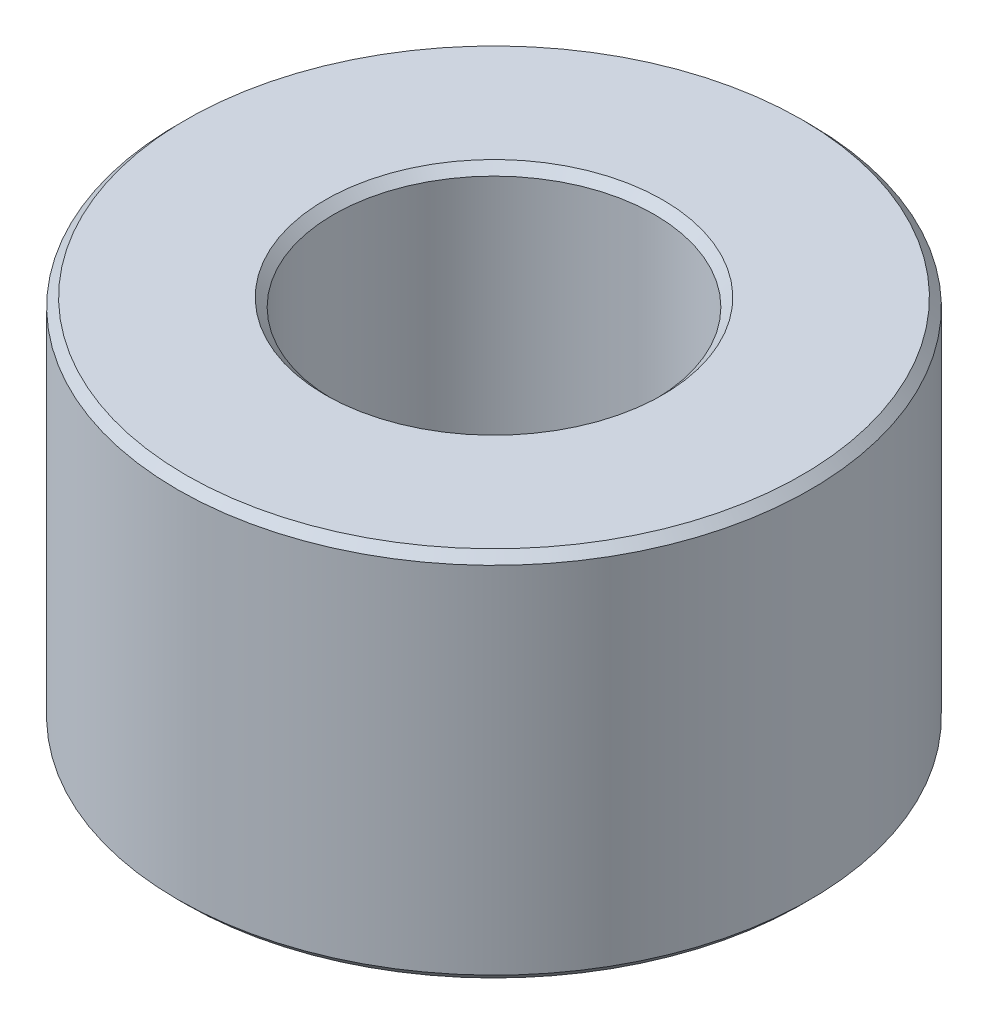
ISO-10303-21;
HEADER;
FILE_DESCRIPTION(('STEP AP214'),'2;1');
FILE_NAME('part.step','',(''),(''),'','','');
FILE_SCHEMA(('AUTOMOTIVE_DESIGN { 1 0 10303 214 1 1 1 1 }'));
ENDSEC;
DATA;
#1=APPLICATION_CONTEXT('core data for automotive mechanical design processes');
#2=APPLICATION_PROTOCOL_DEFINITION('international standard','automotive_design',2000,#1);
#3=PRODUCT_CONTEXT('',#1,'mechanical');
#4=PRODUCT('Part','Part','',(#3));
#5=PRODUCT_RELATED_PRODUCT_CATEGORY('part','',(#4));
#6=PRODUCT_DEFINITION_FORMATION('','',#4);
#7=PRODUCT_DEFINITION_CONTEXT('part definition',#1,'design');
#8=PRODUCT_DEFINITION('design','',#6,#7);
#9=PRODUCT_DEFINITION_SHAPE('','',#8);
#10=(LENGTH_UNIT() NAMED_UNIT(*) SI_UNIT(.MILLI.,.METRE.));
#11=(NAMED_UNIT(*) PLANE_ANGLE_UNIT() SI_UNIT($,.RADIAN.));
#12=(NAMED_UNIT(*) SI_UNIT($,.STERADIAN.) SOLID_ANGLE_UNIT());
#13=UNCERTAINTY_MEASURE_WITH_UNIT(LENGTH_MEASURE(1.E-05),#10,'distance_accuracy_value','');
#14=(GEOMETRIC_REPRESENTATION_CONTEXT(3) GLOBAL_UNCERTAINTY_ASSIGNED_CONTEXT((#13)) GLOBAL_UNIT_ASSIGNED_CONTEXT((#10,
#11,#12)) REPRESENTATION_CONTEXT('',''));
#15=CARTESIAN_POINT('',(0.,0.,0.));
#16=DIRECTION('',(0.,0.,1.));
#17=DIRECTION('',(1.,0.,0.));
#18=AXIS2_PLACEMENT_3D('',#15,#16,#17);
#19=CARTESIAN_POINT('',(0.,38.1927468293201,0.));
#20=DIRECTION('',(0.,-1.,0.));
#21=DIRECTION('',(0.,0.,-1.));
#22=AXIS2_PLACEMENT_3D('',#19,#20,#21);
#23=CYLINDRICAL_SURFACE('',#22,32.5);
#24=CARTESIAN_POINT('',(0.,0.865475347554302,0.));
#25=DIRECTION('',(0.,1.,0.));
#26=DIRECTION('',(0.,0.,1.));
#27=AXIS2_PLACEMENT_3D('',#24,#25,#26);
#28=CIRCLE('',#27,32.5);
#29=CARTESIAN_POINT('',(0.,0.865475347554302,-32.5));
#30=VERTEX_POINT('',#29);
#31=EDGE_CURVE('E10',#30,#30,#28,.T.);
#32=CARTESIAN_POINT('',(0.,37.3272714817659,0.));
#33=DIRECTION('',(0.,1.,0.));
#34=DIRECTION('',(0.,0.,1.));
#35=AXIS2_PLACEMENT_3D('',#32,#33,#34);
#36=CIRCLE('',#35,32.5);
#37=CARTESIAN_POINT('',(0.,37.3272714817658,-32.5));
#38=VERTEX_POINT('',#37);
#39=EDGE_CURVE('E50',#38,#38,#36,.F.);
#40=CARTESIAN_POINT('',(0.,0.865475347554302,-32.5));
#41=CARTESIAN_POINT('',(0.,1.24528572395234,-32.5));
#42=CARTESIAN_POINT('',(0.,1.62509610035038,-32.5));
#43=CARTESIAN_POINT('',(0.,2.38471685314645,-32.5));
#44=CARTESIAN_POINT('',(0.,2.76452722954449,-32.5));
#45=CARTESIAN_POINT('',(0.,3.52414798234056,-32.5));
#46=CARTESIAN_POINT('',(0.,3.9039583587386,-32.5));
#47=CARTESIAN_POINT('',(0.,4.66357911153467,-32.5));
#48=CARTESIAN_POINT('',(0.,5.04338948793271,-32.5));
#49=CARTESIAN_POINT('',(0.,5.80301024072879,-32.5));
#50=CARTESIAN_POINT('',(0.,6.18282061712682,-32.5));
#51=CARTESIAN_POINT('',(0.,6.94244136992289,-32.5));
#52=CARTESIAN_POINT('',(0.,7.32225174632093,-32.5));
#53=CARTESIAN_POINT('',(0.,8.081872499117,-32.5));
#54=CARTESIAN_POINT('',(0.,8.46168287551504,-32.5));
#55=CARTESIAN_POINT('',(0.,9.22130362831111,-32.5));
#56=CARTESIAN_POINT('',(0.,9.60111400470915,-32.5));
#57=CARTESIAN_POINT('',(0.,10.3607347575052,-32.5));
#58=CARTESIAN_POINT('',(0.,10.7405451339033,-32.5));
#59=CARTESIAN_POINT('',(0.,11.5001658866993,-32.5));
#60=CARTESIAN_POINT('',(0.,11.8799762630974,-32.5));
#61=CARTESIAN_POINT('',(0.,12.6395970158934,-32.5));
#62=CARTESIAN_POINT('',(0.,13.0194073922915,-32.5));
#63=CARTESIAN_POINT('',(0.,13.7790281450876,-32.5));
#64=CARTESIAN_POINT('',(0.,14.1588385214856,-32.5));
#65=CARTESIAN_POINT('',(0.,14.9184592742817,-32.5));
#66=CARTESIAN_POINT('',(0.,15.2982696506797,-32.5));
#67=CARTESIAN_POINT('',(0.,16.0578904034758,-32.5));
#68=CARTESIAN_POINT('',(0.,16.4377007798738,-32.5));
#69=CARTESIAN_POINT('',(0.,17.1973215326699,-32.5));
#70=CARTESIAN_POINT('',(0.,17.5771319090679,-32.5));
#71=CARTESIAN_POINT('',(0.,18.336752661864,-32.5));
#72=CARTESIAN_POINT('',(0.,18.716563038262,-32.5));
#73=CARTESIAN_POINT('',(0.,19.4761837910581,-32.5));
#74=CARTESIAN_POINT('',(0.,19.8559941674562,-32.5));
#75=CARTESIAN_POINT('',(0.,20.6156149202522,-32.5));
#76=CARTESIAN_POINT('',(0.,20.9954252966503,-32.5));
#77=CARTESIAN_POINT('',(0.,21.7550460494463,-32.5));
#78=CARTESIAN_POINT('',(0.,22.1348564258444,-32.5));
#79=CARTESIAN_POINT('',(0.,22.8944771786404,-32.5));
#80=CARTESIAN_POINT('',(0.,23.2742875550385,-32.5));
#81=CARTESIAN_POINT('',(0.,24.0339083078346,-32.5));
#82=CARTESIAN_POINT('',(0.,24.4137186842326,-32.5));
#83=CARTESIAN_POINT('',(0.,25.1733394370287,-32.5));
#84=CARTESIAN_POINT('',(0.,25.5531498134267,-32.5));
#85=CARTESIAN_POINT('',(0.,26.3127705662228,-32.5));
#86=CARTESIAN_POINT('',(0.,26.6925809426208,-32.5));
#87=CARTESIAN_POINT('',(0.,27.4522016954169,-32.5));
#88=CARTESIAN_POINT('',(0.,27.8320120718149,-32.5));
#89=CARTESIAN_POINT('',(0.,28.591632824611,-32.5));
#90=CARTESIAN_POINT('',(0.,28.971443201009,-32.5));
#91=CARTESIAN_POINT('',(0.,29.7310639538051,-32.5));
#92=CARTESIAN_POINT('',(0.,30.1108743302031,-32.5));
#93=CARTESIAN_POINT('',(0.,30.8704950829992,-32.5));
#94=CARTESIAN_POINT('',(0.,31.2503054593973,-32.5));
#95=CARTESIAN_POINT('',(0.,32.0099262121933,-32.5));
#96=CARTESIAN_POINT('',(0.,32.3897365885914,-32.5));
#97=CARTESIAN_POINT('',(0.,33.1493573413874,-32.5));
#98=CARTESIAN_POINT('',(0.,33.5291677177855,-32.5));
#99=CARTESIAN_POINT('',(0.,34.2887884705816,-32.5));
#100=CARTESIAN_POINT('',(0.,34.6685988469796,-32.5));
#101=CARTESIAN_POINT('',(0.,35.4282195997757,-32.5));
#102=CARTESIAN_POINT('',(0.,35.8080299761737,-32.5));
#103=CARTESIAN_POINT('',(0.,36.5676507289698,-32.5));
#104=CARTESIAN_POINT('',(0.,36.9474611053678,-32.5));
#105=CARTESIAN_POINT('',(0.,37.3272714817658,-32.5));
#106=B_SPLINE_CURVE_WITH_KNOTS('',3,(#40,#41,#42,#43,#44,#45,#46,#47,#48,#49,#50,#51,#52,#53,
#54,#55,#56,#57,#58,#59,#60,#61,#62,#63,#64,#65,#66,#67,#68,#69,#70,#71,#72,#73,#74,#75,#76,#77,
#78,#79,#80,#81,#82,#83,#84,#85,#86,#87,#88,#89,#90,#91,#92,#93,#94,#95,#96,#97,#98,#99,#100,
#101,#102,#103,#104,#105),.UNSPECIFIED.,.F.,.F.,(4,2,2,2,2,2,2,2,2,2,2,2,2,2,2,2,2,2,2,2,2,2,2,
2,2,2,2,2,2,2,2,2,4),(0.,1.13943112919411,2.27886225838822,3.41829338758233,4.55772451677645,
5.69715564597056,6.83658677516466,7.97601790435877,9.11544903355288,10.254880162747,
11.3943112919411,12.5337424211352,13.6731735503293,14.8126046795234,15.9520358087176,
17.0914669379117,18.2308980671058,19.3703291962999,20.509760325494,21.6491914546881,
22.7886225838822,23.9280537130763,25.0674848422704,26.2069159714646,27.3463471006587,
28.4857782298528,29.6252093590469,30.764640488241,31.9040716174351,33.0435027466292,
34.1829338758233,35.3223650050174,36.4617961342115),.UNSPECIFIED.);
#107=EDGE_CURVE('BSEAM39',#30,#38,#106,.T.);
#108=ORIENTED_EDGE('',*,*,#31,.T.);
#109=ORIENTED_EDGE('',*,*,#39,.T.);
#110=ORIENTED_EDGE('',*,*,#107,.T.);
#111=ORIENTED_EDGE('',*,*,#107,.F.);
#112=EDGE_LOOP('',(#108,#110,#109,#111));
#113=FACE_BOUND('',#112,.T.);
#114=ADVANCED_FACE('F39',(#113),#23,.T.);
#115=CARTESIAN_POINT('',(0.,38.1927468293201,0.));
#116=DIRECTION('',(0.,1.,0.));
#117=DIRECTION('',(0.,0.,1.));
#118=AXIS2_PLACEMENT_3D('',#115,#116,#117);
#119=PLANE('',#118);
#120=CARTESIAN_POINT('',(0.,38.1927468293201,0.));
#121=DIRECTION('',(0.,1.,0.));
#122=DIRECTION('',(0.,0.,1.));
#123=AXIS2_PLACEMENT_3D('',#120,#121,#122);
#124=CIRCLE('',#123,17.3490386487337);
#125=CARTESIAN_POINT('',(0.,38.1927468293201,17.3490386487337));
#126=VERTEX_POINT('',#125);
#127=EDGE_CURVE('E58',#126,#126,#124,.F.);
#128=ORIENTED_EDGE('',*,*,#127,.T.);
#129=EDGE_LOOP('',(#128));
#130=FACE_BOUND('',#129,.T.);
#131=CARTESIAN_POINT('',(0.,38.1927468293201,0.));
#132=DIRECTION('',(0.,1.,0.));
#133=DIRECTION('',(0.,0.,1.));
#134=AXIS2_PLACEMENT_3D('',#131,#132,#133);
#135=CIRCLE('',#134,31.6345246524458);
#136=CARTESIAN_POINT('',(0.,38.1927468293201,31.6345246524458));
#137=VERTEX_POINT('',#136);
#138=EDGE_CURVE('E61',#137,#137,#135,.T.);
#139=ORIENTED_EDGE('',*,*,#138,.T.);
#140=EDGE_LOOP('',(#139));
#141=FACE_BOUND('',#140,.T.);
#142=ADVANCED_FACE('F88',(#130,#141),#119,.T.);
#143=CARTESIAN_POINT('',(0.,0.,0.));
#144=DIRECTION('',(0.,1.,0.));
#145=DIRECTION('',(0.,0.,1.));
#146=AXIS2_PLACEMENT_3D('',#143,#144,#145);
#147=PLANE('',#146);
#148=CARTESIAN_POINT('',(0.,0.,0.));
#149=DIRECTION('',(0.,1.,0.));
#150=DIRECTION('',(0.,0.,1.));
#151=AXIS2_PLACEMENT_3D('',#148,#149,#150);
#152=CIRCLE('',#151,17.3490386487337);
#153=CARTESIAN_POINT('',(0.,0.,-17.3490386487337));
#154=VERTEX_POINT('',#153);
#155=EDGE_CURVE('E51',#154,#154,#152,.T.);
#156=ORIENTED_EDGE('',*,*,#155,.T.);
#157=EDGE_LOOP('',(#156));
#158=FACE_BOUND('',#157,.T.);
#159=CARTESIAN_POINT('',(0.,0.,0.));
#160=DIRECTION('',(0.,1.,0.));
#161=DIRECTION('',(0.,0.,1.));
#162=AXIS2_PLACEMENT_3D('',#159,#160,#161);
#163=CIRCLE('',#162,31.6345246524457);
#164=CARTESIAN_POINT('',(0.,0.,31.6345246524457));
#165=VERTEX_POINT('',#164);
#166=EDGE_CURVE('E54',#165,#165,#163,.F.);
#167=ORIENTED_EDGE('',*,*,#166,.T.);
#168=EDGE_LOOP('',(#167));
#169=FACE_BOUND('',#168,.T.);
#170=ADVANCED_FACE('F83',(#158,#169),#147,.F.);
#171=CARTESIAN_POINT('',(0.,38.1927468293201,0.));
#172=DIRECTION('',(0.,-1.,0.));
#173=DIRECTION('',(0.,0.,-1.));
#174=AXIS2_PLACEMENT_3D('',#171,#172,#173);
#175=CYLINDRICAL_SURFACE('',#174,16.4835633011795);
#176=CARTESIAN_POINT('',(0.,37.3272714817658,0.));
#177=DIRECTION('',(0.,1.,0.));
#178=DIRECTION('',(0.,0.,1.));
#179=AXIS2_PLACEMENT_3D('',#176,#177,#178);
#180=CIRCLE('',#179,16.4835633011795);
#181=CARTESIAN_POINT('',(0.,37.3272714817658,-16.4835633011795));
#182=VERTEX_POINT('',#181);
#183=EDGE_CURVE('E67',#182,#182,#180,.T.);
#184=CARTESIAN_POINT('',(0.,0.86547534755424,0.));
#185=DIRECTION('',(0.,1.,0.));
#186=DIRECTION('',(0.,0.,1.));
#187=AXIS2_PLACEMENT_3D('',#184,#185,#186);
#188=CIRCLE('',#187,16.4835633011795);
#189=CARTESIAN_POINT('',(0.,0.865475347554233,-16.4835633011795));
#190=VERTEX_POINT('',#189);
#191=EDGE_CURVE('E69',#190,#190,#188,.F.);
#192=CARTESIAN_POINT('',(0.,37.3272714817658,-16.4835633011795));
#193=CARTESIAN_POINT('',(0.,36.9474611053678,-16.4835633011795));
#194=CARTESIAN_POINT('',(0.,36.5676507289697,-16.4835633011795));
#195=CARTESIAN_POINT('',(0.,35.8080299761736,-16.4835633011795));
#196=CARTESIAN_POINT('',(0.,35.4282195997756,-16.4835633011795));
#197=CARTESIAN_POINT('',(0.,34.6685988469795,-16.4835633011795));
#198=CARTESIAN_POINT('',(0.,34.2887884705815,-16.4835633011795));
#199=CARTESIAN_POINT('',(0.,33.5291677177854,-16.4835633011795));
#200=CARTESIAN_POINT('',(0.,33.1493573413874,-16.4835633011795));
#201=CARTESIAN_POINT('',(0.,32.3897365885913,-16.4835633011795));
#202=CARTESIAN_POINT('',(0.,32.0099262121933,-16.4835633011795));
#203=CARTESIAN_POINT('',(0.,31.2503054593972,-16.4835633011795));
#204=CARTESIAN_POINT('',(0.,30.8704950829992,-16.4835633011795));
#205=CARTESIAN_POINT('',(0.,30.1108743302031,-16.4835633011795));
#206=CARTESIAN_POINT('',(0.,29.7310639538051,-16.4835633011795));
#207=CARTESIAN_POINT('',(0.,28.971443201009,-16.4835633011795));
#208=CARTESIAN_POINT('',(0.,28.5916328246109,-16.4835633011795));
#209=CARTESIAN_POINT('',(0.,27.8320120718149,-16.4835633011795));
#210=CARTESIAN_POINT('',(0.,27.4522016954168,-16.4835633011795));
#211=CARTESIAN_POINT('',(0.,26.6925809426208,-16.4835633011795));
#212=CARTESIAN_POINT('',(0.,26.3127705662227,-16.4835633011795));
#213=CARTESIAN_POINT('',(0.,25.5531498134266,-16.4835633011795));
#214=CARTESIAN_POINT('',(0.,25.1733394370286,-16.4835633011795));
#215=CARTESIAN_POINT('',(0.,24.4137186842325,-16.4835633011795));
#216=CARTESIAN_POINT('',(0.,24.0339083078345,-16.4835633011795));
#217=CARTESIAN_POINT('',(0.,23.2742875550384,-16.4835633011795));
#218=CARTESIAN_POINT('',(0.,22.8944771786404,-16.4835633011795));
#219=CARTESIAN_POINT('',(0.,22.1348564258443,-16.4835633011795));
#220=CARTESIAN_POINT('',(0.,21.7550460494463,-16.4835633011795));
#221=CARTESIAN_POINT('',(0.,20.9954252966502,-16.4835633011795));
#222=CARTESIAN_POINT('',(0.,20.6156149202522,-16.4835633011795));
#223=CARTESIAN_POINT('',(0.,19.8559941674561,-16.4835633011795));
#224=CARTESIAN_POINT('',(0.,19.4761837910581,-16.4835633011795));
#225=CARTESIAN_POINT('',(0.,18.716563038262,-16.4835633011795));
#226=CARTESIAN_POINT('',(0.,18.3367526618639,-16.4835633011795));
#227=CARTESIAN_POINT('',(0.,17.5771319090679,-16.4835633011795));
#228=CARTESIAN_POINT('',(0.,17.1973215326698,-16.4835633011795));
#229=CARTESIAN_POINT('',(0.,16.4377007798738,-16.4835633011795));
#230=CARTESIAN_POINT('',(0.,16.0578904034757,-16.4835633011795));
#231=CARTESIAN_POINT('',(0.,15.2982696506796,-16.4835633011795));
#232=CARTESIAN_POINT('',(0.,14.9184592742816,-16.4835633011795));
#233=CARTESIAN_POINT('',(0.,14.1588385214855,-16.4835633011795));
#234=CARTESIAN_POINT('',(0.,13.7790281450875,-16.4835633011795));
#235=CARTESIAN_POINT('',(0.,13.0194073922914,-16.4835633011795));
#236=CARTESIAN_POINT('',(0.,12.6395970158934,-16.4835633011795));
#237=CARTESIAN_POINT('',(0.,11.8799762630973,-16.4835633011795));
#238=CARTESIAN_POINT('',(0.,11.5001658866993,-16.4835633011795));
#239=CARTESIAN_POINT('',(0.,10.7405451339032,-16.4835633011795));
#240=CARTESIAN_POINT('',(0.,10.3607347575052,-16.4835633011795));
#241=CARTESIAN_POINT('',(0.,9.60111400470909,-16.4835633011795));
#242=CARTESIAN_POINT('',(0.,9.22130362831105,-16.4835633011795));
#243=CARTESIAN_POINT('',(0.,8.46168287551498,-16.4835633011795));
#244=CARTESIAN_POINT('',(0.,8.08187249911694,-16.4835633011795));
#245=CARTESIAN_POINT('',(0.,7.32225174632087,-16.4835633011795));
#246=CARTESIAN_POINT('',(0.,6.94244136992283,-16.4835633011795));
#247=CARTESIAN_POINT('',(0.,6.18282061712675,-16.4835633011795));
#248=CARTESIAN_POINT('',(0.,5.80301024072872,-16.4835633011795));
#249=CARTESIAN_POINT('',(0.,5.04338948793264,-16.4835633011795));
#250=CARTESIAN_POINT('',(0.,4.66357911153461,-16.4835633011795));
#251=CARTESIAN_POINT('',(0.,3.90395835873853,-16.4835633011795));
#252=CARTESIAN_POINT('',(0.,3.52414798234049,-16.4835633011795));
#253=CARTESIAN_POINT('',(0.,2.76452722954442,-16.4835633011795));
#254=CARTESIAN_POINT('',(0.,2.38471685314638,-16.4835633011795));
#255=CARTESIAN_POINT('',(0.,1.62509610035031,-16.4835633011795));
#256=CARTESIAN_POINT('',(0.,1.24528572395227,-16.4835633011795));
#257=CARTESIAN_POINT('',(0.,0.865475347554233,-16.4835633011795));
#258=B_SPLINE_CURVE_WITH_KNOTS('',3,(#192,#193,#194,#195,#196,#197,#198,#199,#200,#201,#202,
#203,#204,#205,#206,#207,#208,#209,#210,#211,#212,#213,#214,#215,#216,#217,#218,#219,#220,#221,
#222,#223,#224,#225,#226,#227,#228,#229,#230,#231,#232,#233,#234,#235,#236,#237,#238,#239,#240,
#241,#242,#243,#244,#245,#246,#247,#248,#249,#250,#251,#252,#253,#254,#255,#256,#257),
.UNSPECIFIED.,.F.,.F.,(4,2,2,2,2,2,2,2,2,2,2,2,2,2,2,2,2,2,2,2,2,2,2,2,2,2,2,2,2,2,2,2,4),(0.,
1.13943112919411,2.27886225838822,3.41829338758233,4.55772451677644,5.69715564597056,
6.83658677516466,7.97601790435878,9.11544903355289,10.254880162747,11.3943112919411,
12.5337424211352,13.6731735503293,14.8126046795234,15.9520358087176,17.0914669379117,
18.2308980671058,19.3703291962999,20.509760325494,21.6491914546881,22.7886225838822,
23.9280537130763,25.0674848422704,26.2069159714646,27.3463471006587,28.4857782298528,
29.6252093590469,30.764640488241,31.9040716174351,33.0435027466292,34.1829338758233,
35.3223650050175,36.4617961342116),.UNSPECIFIED.);
#259=EDGE_CURVE('BSEAM71',#182,#190,#258,.T.);
#260=ORIENTED_EDGE('',*,*,#183,.T.);
#261=ORIENTED_EDGE('',*,*,#191,.T.);
#262=ORIENTED_EDGE('',*,*,#259,.T.);
#263=ORIENTED_EDGE('',*,*,#259,.F.);
#264=EDGE_LOOP('',(#260,#262,#261,#263));
#265=FACE_BOUND('',#264,.T.);
#266=ADVANCED_FACE('F71',(#265),#175,.F.);
#267=CARTESIAN_POINT('',(0.,37.3272714817658,0.));
#268=DIRECTION('',(0.,1.,0.));
#269=DIRECTION('',(0.,0.,1.));
#270=AXIS2_PLACEMENT_3D('',#267,#268,#269);
#271=CONICAL_SURFACE('',#270,16.4835633011795,0.785398163397446);
#272=ORIENTED_EDGE('',*,*,#127,.F.);
#273=EDGE_LOOP('',(#272));
#274=FACE_BOUND('',#273,.T.);
#275=ORIENTED_EDGE('',*,*,#183,.F.);
#276=EDGE_LOOP('',(#275));
#277=FACE_BOUND('',#276,.T.);
#278=ADVANCED_FACE('F77',(#274,#277),#271,.F.);
#279=CARTESIAN_POINT('',(0.,0.,0.));
#280=DIRECTION('',(0.,-1.,0.));
#281=DIRECTION('',(0.,0.,-1.));
#282=AXIS2_PLACEMENT_3D('',#279,#280,#281);
#283=CONICAL_SURFACE('',#282,17.3490386487337,0.785398163397442);
#284=CARTESIAN_POINT('',(0.,0.86547534755424,-16.4835633011795));
#285=CARTESIAN_POINT('',(0.,0.85645997935055,-16.4925786693831));
#286=CARTESIAN_POINT('',(0.,0.84744461114686,-16.5015940375868));
#287=CARTESIAN_POINT('',(0.,0.829413874739479,-16.5196247739942));
#288=CARTESIAN_POINT('',(0.,0.820398506535789,-16.5286401421979));
#289=CARTESIAN_POINT('',(0.,0.80236777012841,-16.5466708786053));
#290=CARTESIAN_POINT('',(0.,0.79335240192472,-16.555686246809));
#291=CARTESIAN_POINT('',(0.,0.77532166551734,-16.5737169832164));
#292=CARTESIAN_POINT('',(0.,0.76630629731365,-16.58273235142));
#293=CARTESIAN_POINT('',(0.,0.74827556090627,-16.6007630878274));
#294=CARTESIAN_POINT('',(0.,0.73926019270258,-16.6097784560311));
#295=CARTESIAN_POINT('',(0.,0.7212294562952,-16.6278091924385));
#296=CARTESIAN_POINT('',(0.,0.71221408809151,-16.6368245606422));
#297=CARTESIAN_POINT('',(0.,0.69418335168413,-16.6548552970496));
#298=CARTESIAN_POINT('',(0.,0.68516798348044,-16.6638706652533));
#299=CARTESIAN_POINT('',(0.,0.66713724707306,-16.6819014016606));
#300=CARTESIAN_POINT('',(0.,0.65812187886937,-16.6909167698643));
#301=CARTESIAN_POINT('',(0.,0.64009114246199,-16.7089475062717));
#302=CARTESIAN_POINT('',(0.,0.631075774258299,-16.7179628744754));
#303=CARTESIAN_POINT('',(0.,0.61304503785092,-16.7359936108828));
#304=CARTESIAN_POINT('',(0.,0.60402966964723,-16.7450089790865));
#305=CARTESIAN_POINT('',(0.,0.58599893323985,-16.7630397154938));
#306=CARTESIAN_POINT('',(0.,0.57698356503616,-16.7720550836975));
#307=CARTESIAN_POINT('',(0.,0.55895282862878,-16.7900858201049));
#308=CARTESIAN_POINT('',(0.,0.54993746042509,-16.7991011883086));
#309=CARTESIAN_POINT('',(0.,0.53190672401771,-16.817131924716));
#310=CARTESIAN_POINT('',(0.,0.52289135581402,-16.8261472929197));
#311=CARTESIAN_POINT('',(0.,0.50486061940664,-16.8441780293271));
#312=CARTESIAN_POINT('',(0.,0.49584525120295,-16.8531933975307));
#313=CARTESIAN_POINT('',(0.,0.47781451479557,-16.8712241339381));
#314=CARTESIAN_POINT('',(0.,0.468799146591879,-16.8802395021418));
#315=CARTESIAN_POINT('',(0.,0.4507684101845,-16.8982702385492));
#316=CARTESIAN_POINT('',(0.,0.44175304198081,-16.9072856067529));
#317=CARTESIAN_POINT('',(0.,0.42372230557343,-16.9253163431603));
#318=CARTESIAN_POINT('',(0.,0.41470693736974,-16.9343317113639));
#319=CARTESIAN_POINT('',(0.,0.39667620096236,-16.9523624477713));
#320=CARTESIAN_POINT('',(0.,0.38766083275867,-16.961377815975));
#321=CARTESIAN_POINT('',(0.,0.36963009635129,-16.9794085523824));
#322=CARTESIAN_POINT('',(0.,0.3606147281476,-16.9884239205861));
#323=CARTESIAN_POINT('',(0.,0.34258399174022,-17.0064546569935));
#324=CARTESIAN_POINT('',(0.,0.33356862353653,-17.0154700251972));
#325=CARTESIAN_POINT('',(0.,0.31553788712915,-17.0335007616045));
#326=CARTESIAN_POINT('',(0.,0.30652251892546,-17.0425161298082));
#327=CARTESIAN_POINT('',(0.,0.28849178251808,-17.0605468662156));
#328=CARTESIAN_POINT('',(0.,0.27947641431439,-17.0695622344193));
#329=CARTESIAN_POINT('',(0.,0.26144567790701,-17.0875929708267));
#330=CARTESIAN_POINT('',(0.,0.25243030970332,-17.0966083390304));
#331=CARTESIAN_POINT('',(0.,0.23439957329594,-17.1146390754378));
#332=CARTESIAN_POINT('',(0.,0.22538420509225,-17.1236544436414));
#333=CARTESIAN_POINT('',(0.,0.20735346868487,-17.1416851800488));
#334=CARTESIAN_POINT('',(0.,0.19833810048118,-17.1507005482525));
#335=CARTESIAN_POINT('',(0.,0.1803073640738,-17.1687312846599));
#336=CARTESIAN_POINT('',(0.,0.17129199587011,-17.1777466528636));
#337=CARTESIAN_POINT('',(0.,0.15326125946273,-17.195777389271));
#338=CARTESIAN_POINT('',(0.,0.14424589125904,-17.2047927574746));
#339=CARTESIAN_POINT('',(0.,0.12621515485166,-17.222823493882));
#340=CARTESIAN_POINT('',(0.,0.11719978664797,-17.2318388620857));
#341=CARTESIAN_POINT('',(0.,0.0991690502405898,-17.2498695984931));
#342=CARTESIAN_POINT('',(0.,0.0901536820369002,-17.2588849666968));
#343=CARTESIAN_POINT('',(0.,0.0721229456295203,-17.2769157031042));
#344=CARTESIAN_POINT('',(0.,0.0631075774258301,-17.2859310713079));
#345=CARTESIAN_POINT('',(0.,0.0450768410184499,-17.3039618077152));
#346=CARTESIAN_POINT('',(0.,0.0360614728147599,-17.3129771759189));
#347=CARTESIAN_POINT('',(0.,0.0180307364073801,-17.3310079123263));
#348=CARTESIAN_POINT('',(0.,0.00901536820369011,-17.34002328053));
#349=CARTESIAN_POINT('',(0.,0.,-17.3490386487337));
#350=B_SPLINE_CURVE_WITH_KNOTS('',3,(#284,#285,#286,#287,#288,#289,#290,#291,#292,#293,#294,
#295,#296,#297,#298,#299,#300,#301,#302,#303,#304,#305,#306,#307,#308,#309,#310,#311,#312,#313,
#314,#315,#316,#317,#318,#319,#320,#321,#322,#323,#324,#325,#326,#327,#328,#329,#330,#331,#332,
#333,#334,#335,#336,#337,#338,#339,#340,#341,#342,#343,#344,#345,#346,#347,#348,#349),
.UNSPECIFIED.,.F.,.F.,(4,2,2,2,2,2,2,2,2,2,2,2,2,2,2,2,2,2,2,2,2,2,2,2,2,2,2,2,2,2,2,2,4),(0.,
0.0382489679503361,0.0764979359006722,0.114746903851011,0.152995871801347,0.191244839751683,
0.229493807702019,0.267742775652355,0.305991743602691,0.344240711553027,0.382489679503366,
0.420738647453702,0.458987615404038,0.497236583354374,0.53548555130471,0.573734519255046,
0.611983487205385,0.650232455155721,0.688481423106057,0.726730391056393,0.764979359006729,
0.803228326957065,0.841477294907401,0.879726262857739,0.917975230808076,0.956224198758411,
0.994473166708748,1.03272213465908,1.07097110260942,1.10922007055976,1.14746903851009,
1.18571800646043,1.22396697441077),.UNSPECIFIED.);
#351=EDGE_CURVE('BSEAM73',#190,#154,#350,.T.);
#352=ORIENTED_EDGE('',*,*,#191,.F.);
#353=ORIENTED_EDGE('',*,*,#155,.F.);
#354=ORIENTED_EDGE('',*,*,#351,.T.);
#355=ORIENTED_EDGE('',*,*,#351,.F.);
#356=EDGE_LOOP('',(#352,#354,#353,#355));
#357=FACE_BOUND('',#356,.T.);
#358=ADVANCED_FACE('F73',(#357),#283,.F.);
#359=CARTESIAN_POINT('',(0.,0.865475347554302,0.));
#360=DIRECTION('',(0.,1.,0.));
#361=DIRECTION('',(0.,0.,1.));
#362=AXIS2_PLACEMENT_3D('',#359,#360,#361);
#363=CONICAL_SURFACE('',#362,32.5,0.785398163397448);
#364=ORIENTED_EDGE('',*,*,#166,.F.);
#365=EDGE_LOOP('',(#364));
#366=FACE_BOUND('',#365,.T.);
#367=ORIENTED_EDGE('',*,*,#31,.F.);
#368=EDGE_LOOP('',(#367));
#369=FACE_BOUND('',#368,.T.);
#370=ADVANCED_FACE('F76',(#366,#369),#363,.T.);
#371=CARTESIAN_POINT('',(0.,38.1927468293201,0.));
#372=DIRECTION('',(0.,-1.,0.));
#373=DIRECTION('',(0.,0.,-1.));
#374=AXIS2_PLACEMENT_3D('',#371,#372,#373);
#375=CONICAL_SURFACE('',#374,31.6345246524458,0.785398163397444);
#376=ORIENTED_EDGE('',*,*,#39,.F.);
#377=EDGE_LOOP('',(#376));
#378=FACE_BOUND('',#377,.T.);
#379=ORIENTED_EDGE('',*,*,#138,.F.);
#380=EDGE_LOOP('',(#379));
#381=FACE_BOUND('',#380,.T.);
#382=ADVANCED_FACE('F45',(#378,#381),#375,.T.);
#383=CLOSED_SHELL('',(#114,#142,#170,#266,#278,#358,#370,#382));
#384=MANIFOLD_SOLID_BREP('B2',#383);
#385=ADVANCED_BREP_SHAPE_REPRESENTATION('',(#18,#384),#14);
#386=SHAPE_DEFINITION_REPRESENTATION(#9,#385);
ENDSEC;
END-ISO-10303-21;
